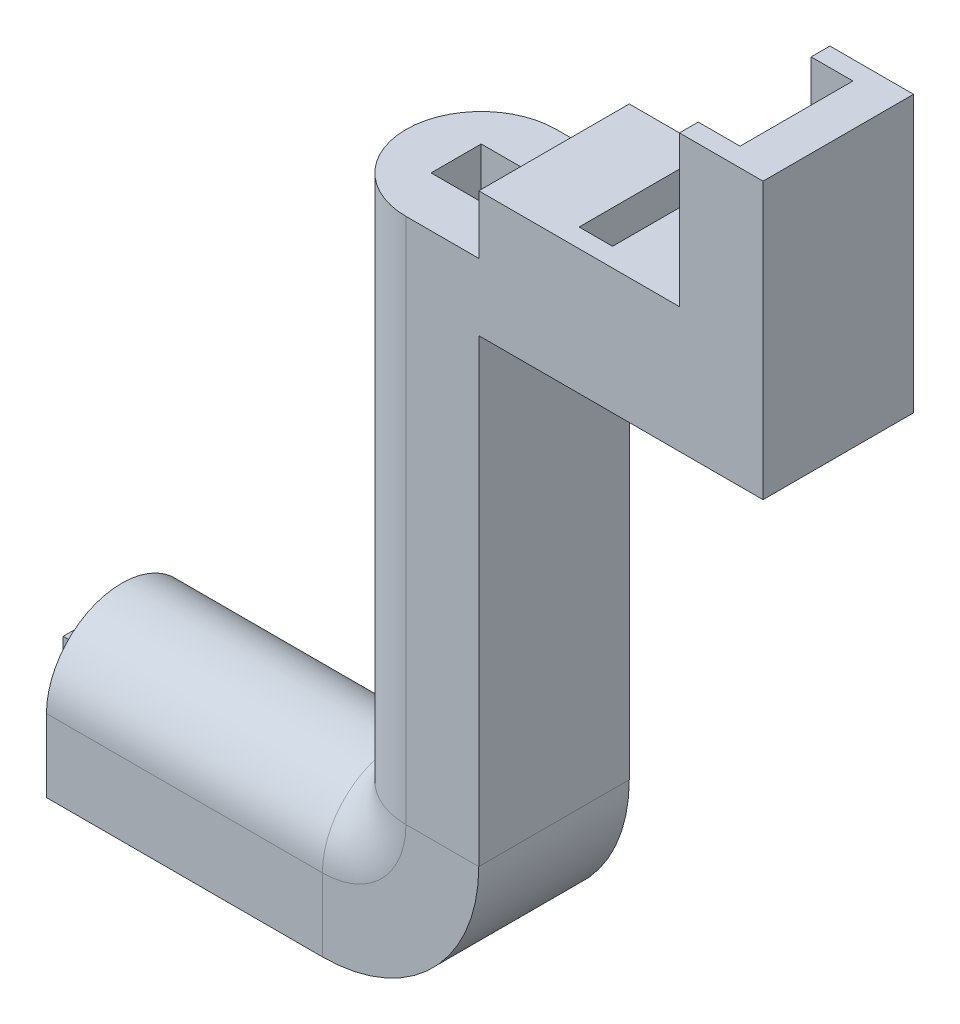
ISO-10303-21;
HEADER;
FILE_DESCRIPTION(('STEP AP214'),'2;1');
FILE_NAME('part.step','',(''),(''),'','','');
FILE_SCHEMA(('AUTOMOTIVE_DESIGN { 1 0 10303 214 1 1 1 1 }'));
ENDSEC;
DATA;
#1=APPLICATION_CONTEXT('core data for automotive mechanical design processes');
#2=APPLICATION_PROTOCOL_DEFINITION('international standard','automotive_design',2000,#1);
#3=PRODUCT_CONTEXT('',#1,'mechanical');
#4=PRODUCT('Part','Part','',(#3));
#5=PRODUCT_RELATED_PRODUCT_CATEGORY('part','',(#4));
#6=PRODUCT_DEFINITION_FORMATION('','',#4);
#7=PRODUCT_DEFINITION_CONTEXT('part definition',#1,'design');
#8=PRODUCT_DEFINITION('design','',#6,#7);
#9=PRODUCT_DEFINITION_SHAPE('','',#8);
#10=(LENGTH_UNIT() NAMED_UNIT(*) SI_UNIT(.MILLI.,.METRE.));
#11=(NAMED_UNIT(*) PLANE_ANGLE_UNIT() SI_UNIT($,.RADIAN.));
#12=(NAMED_UNIT(*) SI_UNIT($,.STERADIAN.) SOLID_ANGLE_UNIT());
#13=UNCERTAINTY_MEASURE_WITH_UNIT(LENGTH_MEASURE(1.E-05),#10,'distance_accuracy_value','');
#14=(GEOMETRIC_REPRESENTATION_CONTEXT(3) GLOBAL_UNCERTAINTY_ASSIGNED_CONTEXT((#13)) GLOBAL_UNIT_ASSIGNED_CONTEXT((#10,
#11,#12)) REPRESENTATION_CONTEXT('',''));
#15=CARTESIAN_POINT('',(0.,0.,0.));
#16=DIRECTION('',(0.,0.,1.));
#17=DIRECTION('',(1.,0.,0.));
#18=AXIS2_PLACEMENT_3D('',#15,#16,#17);
#19=CARTESIAN_POINT('',(0.,90.7082039324991,0.));
#20=DIRECTION('',(0.,-1.,0.));
#21=DIRECTION('',(0.,0.,-1.));
#22=AXIS2_PLACEMENT_3D('',#19,#20,#21);
#23=PLANE('',#22);
#24=DIRECTION('',(-1.,0.,0.));
#25=VECTOR('',#24,1.);
#26=CARTESIAN_POINT('',(42.,90.7082039324991,9.00000000000001));
#27=LINE('',#26,#25);
#28=CARTESIAN_POINT('',(60.7082039324993,90.7082039324991,9.00000000000003));
#29=VERTEX_POINT('',#28);
#30=CARTESIAN_POINT('',(52.,90.7082039324991,9.));
#31=VERTEX_POINT('',#30);
#32=EDGE_CURVE('E289',#29,#31,#27,.T.);
#33=ORIENTED_EDGE('',*,*,#32,.F.);
#34=DIRECTION('',(0.,0.,1.));
#35=VECTOR('',#34,1.);
#36=CARTESIAN_POINT('',(60.7082039324993,90.7082039324991,-9.));
#37=LINE('',#36,#35);
#38=CARTESIAN_POINT('',(60.7082039324993,90.7082039324991,-9.));
#39=VERTEX_POINT('',#38);
#40=EDGE_CURVE('E292',#39,#29,#37,.T.);
#41=ORIENTED_EDGE('',*,*,#40,.F.);
#42=DIRECTION('',(1.,0.,0.));
#43=VECTOR('',#42,1.);
#44=CARTESIAN_POINT('',(42.,90.7082039324991,-9.));
#45=LINE('',#44,#43);
#46=CARTESIAN_POINT('',(52.,90.7082039324991,-9.));
#47=VERTEX_POINT('',#46);
#48=EDGE_CURVE('E295',#47,#39,#45,.T.);
#49=ORIENTED_EDGE('',*,*,#48,.F.);
#50=CARTESIAN_POINT('',(52.,90.7082039324991,0.));
#51=DIRECTION('',(0.,-1.,0.));
#52=DIRECTION('',(0.,0.,-1.));
#53=AXIS2_PLACEMENT_3D('',#50,#51,#52);
#54=CIRCLE('',#53,9.);
#55=EDGE_CURVE('E63',#31,#47,#54,.T.);
#56=ORIENTED_EDGE('',*,*,#55,.F.);
#57=EDGE_LOOP('',(#33,#41,#49,#56));
#58=FACE_BOUND('',#57,.T.);
#59=DIRECTION('',(0.,0.,1.));
#60=VECTOR('',#59,1.);
#61=CARTESIAN_POINT('',(55.,90.7082039324991,3.));
#62=LINE('',#61,#60);
#63=CARTESIAN_POINT('',(55.,90.7082039324991,-3.));
#64=VERTEX_POINT('',#63);
#65=CARTESIAN_POINT('',(55.,90.7082039324991,3.));
#66=VERTEX_POINT('',#65);
#67=EDGE_CURVE('E55',#64,#66,#62,.T.);
#68=ORIENTED_EDGE('',*,*,#67,.T.);
#69=DIRECTION('',(-1.,0.,0.));
#70=VECTOR('',#69,1.);
#71=CARTESIAN_POINT('',(49.,90.7082039324991,3.));
#72=LINE('',#71,#70);
#73=CARTESIAN_POINT('',(49.,90.7082039324991,3.));
#74=VERTEX_POINT('',#73);
#75=EDGE_CURVE('E261',#66,#74,#72,.T.);
#76=ORIENTED_EDGE('',*,*,#75,.T.);
#77=DIRECTION('',(0.,0.,-1.));
#78=VECTOR('',#77,1.);
#79=CARTESIAN_POINT('',(49.,90.7082039324991,3.));
#80=LINE('',#79,#78);
#81=CARTESIAN_POINT('',(49.,90.7082039324991,-3.));
#82=VERTEX_POINT('',#81);
#83=EDGE_CURVE('E265',#74,#82,#80,.T.);
#84=ORIENTED_EDGE('',*,*,#83,.T.);
#85=DIRECTION('',(1.,0.,0.));
#86=VECTOR('',#85,1.);
#87=CARTESIAN_POINT('',(49.,90.7082039324991,-3.));
#88=LINE('',#87,#86);
#89=EDGE_CURVE('E274',#82,#64,#88,.T.);
#90=ORIENTED_EDGE('',*,*,#89,.T.);
#91=EDGE_LOOP('',(#68,#76,#84,#90));
#92=FACE_BOUND('',#91,.T.);
#93=ADVANCED_FACE('F39',(#58,#92),#23,.F.);
#94=CARTESIAN_POINT('',(52.,97.7082039324994,0.));
#95=DIRECTION('',(0.,1.,0.));
#96=DIRECTION('',(0.,0.,-1.));
#97=AXIS2_PLACEMENT_3D('',#94,#95,#96);
#98=PLANE('',#97);
#99=DIRECTION('',(0.,0.,1.));
#100=VECTOR('',#99,1.);
#101=CARTESIAN_POINT('',(70.4582039324994,97.7082039324994,6.75000000000001));
#102=LINE('',#101,#100);
#103=CARTESIAN_POINT('',(70.4582039324994,97.7082039324994,-6.74999999999999));
#104=VERTEX_POINT('',#103);
#105=CARTESIAN_POINT('',(70.4582039324994,97.7082039324994,6.75000000000001));
#106=VERTEX_POINT('',#105);
#107=EDGE_CURVE('E363',#104,#106,#102,.T.);
#108=ORIENTED_EDGE('',*,*,#107,.F.);
#109=DIRECTION('',(-1.,0.,0.));
#110=VECTOR('',#109,1.);
#111=CARTESIAN_POINT('',(74.4582039324994,97.7082039324994,-6.74999999999999));
#112=LINE('',#111,#110);
#113=CARTESIAN_POINT('',(74.4582039324994,97.7082039324994,-6.74999999999999));
#114=VERTEX_POINT('',#113);
#115=EDGE_CURVE('E369',#114,#104,#112,.T.);
#116=ORIENTED_EDGE('',*,*,#115,.F.);
#117=DIRECTION('',(0.,0.,-1.));
#118=VECTOR('',#117,1.);
#119=CARTESIAN_POINT('',(74.4582039324994,97.7082039324994,6.75000000000001));
#120=LINE('',#119,#118);
#121=CARTESIAN_POINT('',(74.4582039324994,97.7082039324994,6.75000000000001));
#122=VERTEX_POINT('',#121);
#123=EDGE_CURVE('E388',#122,#114,#120,.T.);
#124=ORIENTED_EDGE('',*,*,#123,.F.);
#125=DIRECTION('',(1.,0.,0.));
#126=VECTOR('',#125,1.);
#127=CARTESIAN_POINT('',(74.4582039324994,97.7082039324994,6.75000000000001));
#128=LINE('',#127,#126);
#129=EDGE_CURVE('E384',#106,#122,#128,.T.);
#130=ORIENTED_EDGE('',*,*,#129,.F.);
#131=EDGE_LOOP('',(#108,#116,#124,#130));
#132=FACE_BOUND('',#131,.T.);
#133=DIRECTION('',(-1.,0.,0.));
#134=VECTOR('',#133,1.);
#135=CARTESIAN_POINT('',(60.7082039324994,97.7082039324994,-9.));
#136=LINE('',#135,#134);
#137=CARTESIAN_POINT('',(84.7082039324993,97.7082039324994,-8.99999999999999));
#138=VERTEX_POINT('',#137);
#139=CARTESIAN_POINT('',(60.7082039324993,97.7082039324991,-9.));
#140=VERTEX_POINT('',#139);
#141=EDGE_CURVE('E474',#138,#140,#136,.T.);
#142=ORIENTED_EDGE('',*,*,#141,.T.);
#143=DIRECTION('',(0.,0.,1.));
#144=VECTOR('',#143,1.);
#145=CARTESIAN_POINT('',(60.7082039324993,97.7082039324991,-9.));
#146=LINE('',#145,#144);
#147=CARTESIAN_POINT('',(60.7082039324993,97.7082039324991,9.00000000000003));
#148=VERTEX_POINT('',#147);
#149=EDGE_CURVE('E283',#140,#148,#146,.T.);
#150=ORIENTED_EDGE('',*,*,#149,.T.);
#151=DIRECTION('',(1.,0.,0.));
#152=VECTOR('',#151,1.);
#153=CARTESIAN_POINT('',(52.,97.7082039324994,9.));
#154=LINE('',#153,#152);
#155=CARTESIAN_POINT('',(84.7082039324993,97.7082039324994,8.99999999999999));
#156=VERTEX_POINT('',#155);
#157=EDGE_CURVE('E504',#148,#156,#154,.T.);
#158=ORIENTED_EDGE('',*,*,#157,.T.);
#159=DIRECTION('',(0.,0.,-1.));
#160=VECTOR('',#159,1.);
#161=CARTESIAN_POINT('',(84.7082039324993,97.7082039324994,56.3814309619285));
#162=LINE('',#161,#160);
#163=CARTESIAN_POINT('',(84.7082039324994,97.7082039324994,6.75));
#164=VERTEX_POINT('',#163);
#165=EDGE_CURVE('E475',#156,#164,#162,.T.);
#166=ORIENTED_EDGE('',*,*,#165,.T.);
#167=DIRECTION('',(-1.,0.,0.));
#168=VECTOR('',#167,1.);
#169=CARTESIAN_POINT('',(89.7082039324994,97.7082039324994,6.75));
#170=LINE('',#169,#168);
#171=CARTESIAN_POINT('',(89.7082039324994,97.7082039324994,6.75));
#172=VERTEX_POINT('',#171);
#173=EDGE_CURVE('E415',#172,#164,#170,.T.);
#174=ORIENTED_EDGE('',*,*,#173,.F.);
#175=DIRECTION('',(0.,0.,1.));
#176=VECTOR('',#175,1.);
#177=CARTESIAN_POINT('',(89.7082039324994,97.7082039324994,6.75));
#178=LINE('',#177,#176);
#179=CARTESIAN_POINT('',(89.7082039324994,97.7082039324994,-6.75));
#180=VERTEX_POINT('',#179);
#181=EDGE_CURVE('E408',#180,#172,#178,.T.);
#182=ORIENTED_EDGE('',*,*,#181,.F.);
#183=DIRECTION('',(1.,0.,0.));
#184=VECTOR('',#183,1.);
#185=CARTESIAN_POINT('',(89.7082039324994,97.7082039324994,-6.75));
#186=LINE('',#185,#184);
#187=CARTESIAN_POINT('',(84.7082039324994,97.7082039324994,-6.75));
#188=VERTEX_POINT('',#187);
#189=EDGE_CURVE('E411',#188,#180,#186,.T.);
#190=ORIENTED_EDGE('',*,*,#189,.F.);
#191=EDGE_CURVE('E456',#188,#138,#162,.T.);
#192=ORIENTED_EDGE('',*,*,#191,.T.);
#193=EDGE_LOOP('',(#142,#150,#158,#166,#174,#182,#190,#192));
#194=FACE_BOUND('',#193,.T.);
#195=ADVANCED_FACE('F637',(#132,#194),#98,.T.);
#196=CARTESIAN_POINT('',(60.7082039324994,97.7082039324994,-9.));
#197=DIRECTION('',(0.,0.,1.));
#198=DIRECTION('',(1.,0.,0.));
#199=AXIS2_PLACEMENT_3D('',#196,#197,#198);
#200=PLANE('',#199);
#201=DIRECTION('',(0.,1.,0.));
#202=VECTOR('',#201,1.);
#203=CARTESIAN_POINT('',(60.7082039324993,90.7082039324991,-9.));
#204=LINE('',#203,#202);
#205=EDGE_CURVE('E303',#39,#140,#204,.T.);
#206=ORIENTED_EDGE('',*,*,#205,.T.);
#207=ORIENTED_EDGE('',*,*,#141,.F.);
#208=DIRECTION('',(0.,1.,0.));
#209=VECTOR('',#208,1.);
#210=CARTESIAN_POINT('',(84.7082039324993,97.7082039324994,-8.99999999999999));
#211=LINE('',#210,#209);
#212=CARTESIAN_POINT('',(84.7082039324994,115.708203932499,-9.));
#213=VERTEX_POINT('',#212);
#214=EDGE_CURVE('E448',#138,#213,#211,.T.);
#215=ORIENTED_EDGE('',*,*,#214,.T.);
#216=DIRECTION('',(1.,0.,0.));
#217=VECTOR('',#216,1.);
#218=CARTESIAN_POINT('',(94.7082039324993,115.708203932499,-8.99999999999999));
#219=LINE('',#218,#217);
#220=CARTESIAN_POINT('',(94.7082039324994,115.708203932499,-8.99999999999999));
#221=VERTEX_POINT('',#220);
#222=EDGE_CURVE('E444',#213,#221,#219,.T.);
#223=ORIENTED_EDGE('',*,*,#222,.T.);
#224=DIRECTION('',(0.,-1.,0.));
#225=VECTOR('',#224,1.);
#226=CARTESIAN_POINT('',(94.7082039324994,82.7082039324994,-8.99999999999999));
#227=LINE('',#226,#225);
#228=CARTESIAN_POINT('',(94.7082039324994,82.7082039324994,-8.99999999999999));
#229=VERTEX_POINT('',#228);
#230=EDGE_CURVE('E440',#221,#229,#227,.T.);
#231=ORIENTED_EDGE('',*,*,#230,.T.);
#232=DIRECTION('',(-1.,0.,0.));
#233=VECTOR('',#232,1.);
#234=CARTESIAN_POINT('',(60.7082039324994,82.7082039324994,-9.));
#235=LINE('',#234,#233);
#236=CARTESIAN_POINT('',(60.7082039324994,82.7082039324994,-9.));
#237=VERTEX_POINT('',#236);
#238=EDGE_CURVE('E452',#229,#237,#235,.T.);
#239=ORIENTED_EDGE('',*,*,#238,.T.);
#240=DIRECTION('',(0.,-1.,0.));
#241=VECTOR('',#240,1.);
#242=CARTESIAN_POINT('',(60.7082039324994,97.7082039324994,-9.));
#243=LINE('',#242,#241);
#244=CARTESIAN_POINT('',(60.7082039324994,27.7082039324994,-9.));
#245=VERTEX_POINT('',#244);
#246=EDGE_CURVE('E497',#237,#245,#243,.T.);
#247=ORIENTED_EDGE('',*,*,#246,.T.);
#248=DIRECTION('',(-1.,0.,0.));
#249=VECTOR('',#248,1.);
#250=CARTESIAN_POINT('',(60.7082039324994,27.7082039324994,-9.));
#251=LINE('',#250,#249);
#252=CARTESIAN_POINT('',(52.,27.7082039324994,-9.));
#253=VERTEX_POINT('',#252);
#254=EDGE_CURVE('E501',#245,#253,#251,.T.);
#255=ORIENTED_EDGE('',*,*,#254,.T.);
#256=DIRECTION('',(0.,-1.,0.));
#257=VECTOR('',#256,1.);
#258=CARTESIAN_POINT('',(52.,97.7082039324994,-9.));
#259=LINE('',#258,#257);
#260=EDGE_CURVE('E525',#47,#253,#259,.T.);
#261=ORIENTED_EDGE('',*,*,#260,.F.);
#262=ORIENTED_EDGE('',*,*,#48,.T.);
#263=EDGE_LOOP('',(#206,#207,#215,#223,#231,#239,#247,#255,#261,#262));
#264=FACE_BOUND('',#263,.T.);
#265=ADVANCED_FACE('F612',(#264),#200,.F.);
#266=CARTESIAN_POINT('',(52.,97.7082039324994,9.));
#267=DIRECTION('',(0.,0.,-1.));
#268=DIRECTION('',(-1.,0.,0.));
#269=AXIS2_PLACEMENT_3D('',#266,#267,#268);
#270=PLANE('',#269);
#271=DIRECTION('',(0.,1.,0.));
#272=VECTOR('',#271,1.);
#273=CARTESIAN_POINT('',(60.7082039324993,90.7082039324991,9.00000000000003));
#274=LINE('',#273,#272);
#275=EDGE_CURVE('E299',#29,#148,#274,.T.);
#276=ORIENTED_EDGE('',*,*,#275,.F.);
#277=ORIENTED_EDGE('',*,*,#32,.T.);
#278=DIRECTION('',(0.,-1.,0.));
#279=VECTOR('',#278,1.);
#280=CARTESIAN_POINT('',(52.,97.7082039324994,9.));
#281=LINE('',#280,#279);
#282=CARTESIAN_POINT('',(52.,27.7082039324994,9.));
#283=VERTEX_POINT('',#282);
#284=EDGE_CURVE('E540',#31,#283,#281,.T.);
#285=ORIENTED_EDGE('',*,*,#284,.T.);
#286=DIRECTION('',(1.,0.,0.));
#287=VECTOR('',#286,1.);
#288=CARTESIAN_POINT('',(52.,27.7082039324994,9.));
#289=LINE('',#288,#287);
#290=CARTESIAN_POINT('',(60.7082039324994,27.7082039324994,9.));
#291=VERTEX_POINT('',#290);
#292=EDGE_CURVE('E518',#283,#291,#289,.T.);
#293=ORIENTED_EDGE('',*,*,#292,.T.);
#294=DIRECTION('',(0.,-1.,0.));
#295=VECTOR('',#294,1.);
#296=CARTESIAN_POINT('',(60.7082039324994,97.7082039324994,9.));
#297=LINE('',#296,#295);
#298=CARTESIAN_POINT('',(60.7082039324994,82.7082039324994,9.));
#299=VERTEX_POINT('',#298);
#300=EDGE_CURVE('E498',#299,#291,#297,.T.);
#301=ORIENTED_EDGE('',*,*,#300,.F.);
#302=DIRECTION('',(-1.,0.,0.));
#303=VECTOR('',#302,1.);
#304=CARTESIAN_POINT('',(60.7082039324994,82.7082039324994,9.));
#305=LINE('',#304,#303);
#306=CARTESIAN_POINT('',(94.7082039324994,82.7082039324994,8.99999999999999));
#307=VERTEX_POINT('',#306);
#308=EDGE_CURVE('E470',#307,#299,#305,.T.);
#309=ORIENTED_EDGE('',*,*,#308,.F.);
#310=DIRECTION('',(0.,-1.,0.));
#311=VECTOR('',#310,1.);
#312=CARTESIAN_POINT('',(94.7082039324994,82.7082039324994,8.99999999999999));
#313=LINE('',#312,#311);
#314=CARTESIAN_POINT('',(94.7082039324994,115.708203932499,8.99999999999999));
#315=VERTEX_POINT('',#314);
#316=EDGE_CURVE('E466',#315,#307,#313,.T.);
#317=ORIENTED_EDGE('',*,*,#316,.F.);
#318=DIRECTION('',(1.,0.,0.));
#319=VECTOR('',#318,1.);
#320=CARTESIAN_POINT('',(94.7082039324993,115.708203932499,8.99999999999999));
#321=LINE('',#320,#319);
#322=CARTESIAN_POINT('',(84.7082039324994,115.708203932499,8.99999999999999));
#323=VERTEX_POINT('',#322);
#324=EDGE_CURVE('E461',#323,#315,#321,.T.);
#325=ORIENTED_EDGE('',*,*,#324,.F.);
#326=DIRECTION('',(0.,1.,0.));
#327=VECTOR('',#326,1.);
#328=CARTESIAN_POINT('',(84.7082039324993,97.7082039324994,8.99999999999999));
#329=LINE('',#328,#327);
#330=EDGE_CURVE('E457',#156,#323,#329,.T.);
#331=ORIENTED_EDGE('',*,*,#330,.F.);
#332=ORIENTED_EDGE('',*,*,#157,.F.);
#333=EDGE_LOOP('',(#276,#277,#285,#293,#301,#309,#317,#325,#331,#332));
#334=FACE_BOUND('',#333,.T.);
#335=ADVANCED_FACE('F605',(#334),#270,.F.);
#336=CARTESIAN_POINT('',(-38.5,9.,-9.));
#337=DIRECTION('',(0.,-1.,0.));
#338=DIRECTION('',(0.,0.,-1.));
#339=AXIS2_PLACEMENT_3D('',#336,#337,#338);
#340=PLANE('',#339);
#341=DIRECTION('',(1.,0.,0.));
#342=VECTOR('',#341,1.);
#343=CARTESIAN_POINT('',(-38.5,9.,9.));
#344=LINE('',#343,#342);
#345=CARTESIAN_POINT('',(9.,9.,9.));
#346=VERTEX_POINT('',#345);
#347=CARTESIAN_POINT('',(42.,9.,9.));
#348=VERTEX_POINT('',#347);
#349=EDGE_CURVE('E565',#346,#348,#344,.T.);
#350=ORIENTED_EDGE('',*,*,#349,.F.);
#351=DIRECTION('',(0.,0.,-1.));
#352=VECTOR('',#351,1.);
#353=CARTESIAN_POINT('',(9.,9.,-9.));
#354=LINE('',#353,#352);
#355=CARTESIAN_POINT('',(9.,9.,-9.));
#356=VERTEX_POINT('',#355);
#357=EDGE_CURVE('E356',#346,#356,#354,.T.);
#358=ORIENTED_EDGE('',*,*,#357,.T.);
#359=DIRECTION('',(1.,0.,0.));
#360=VECTOR('',#359,1.);
#361=CARTESIAN_POINT('',(-38.5,9.,-9.));
#362=LINE('',#361,#360);
#363=CARTESIAN_POINT('',(42.,9.,-9.));
#364=VERTEX_POINT('',#363);
#365=EDGE_CURVE('E562',#356,#364,#362,.T.);
#366=ORIENTED_EDGE('',*,*,#365,.T.);
#367=DIRECTION('',(0.,0.,-1.));
#368=VECTOR('',#367,1.);
#369=CARTESIAN_POINT('',(42.,9.,9.));
#370=LINE('',#369,#368);
#371=EDGE_CURVE('E505',#348,#364,#370,.T.);
#372=ORIENTED_EDGE('',*,*,#371,.F.);
#373=EDGE_LOOP('',(#350,#358,#366,#372));
#374=FACE_BOUND('',#373,.T.);
#375=ADVANCED_FACE('F599',(#374),#340,.T.);
#376=CARTESIAN_POINT('',(-38.5,17.7082039324994,0.));
#377=DIRECTION('',(1.,0.,0.));
#378=DIRECTION('',(0.,0.,-1.));
#379=AXIS2_PLACEMENT_3D('',#376,#377,#378);
#380=CYLINDRICAL_SURFACE('',#379,9.);
#381=DIRECTION('',(1.,0.,0.));
#382=VECTOR('',#381,1.);
#383=CARTESIAN_POINT('',(-38.5,17.7082039324994,-9.));
#384=LINE('',#383,#382);
#385=CARTESIAN_POINT('',(9.,17.7082039324994,-9.));
#386=VERTEX_POINT('',#385);
#387=CARTESIAN_POINT('',(42.,17.7082039324994,-9.));
#388=VERTEX_POINT('',#387);
#389=EDGE_CURVE('E48',#386,#388,#384,.T.);
#390=ORIENTED_EDGE('',*,*,#389,.F.);
#391=CARTESIAN_POINT('',(9.,17.7082039324994,0.));
#392=DIRECTION('',(-1.,0.,0.));
#393=DIRECTION('',(0.,0.,1.));
#394=AXIS2_PLACEMENT_3D('',#391,#392,#393);
#395=CIRCLE('',#394,9.);
#396=CARTESIAN_POINT('',(9.,17.7082039324994,9.));
#397=VERTEX_POINT('',#396);
#398=EDGE_CURVE('E352',#386,#397,#395,.F.);
#399=ORIENTED_EDGE('',*,*,#398,.T.);
#400=DIRECTION('',(1.,0.,0.));
#401=VECTOR('',#400,1.);
#402=CARTESIAN_POINT('',(-38.5,17.7082039324994,9.));
#403=LINE('',#402,#401);
#404=CARTESIAN_POINT('',(42.,17.7082039324994,9.));
#405=VERTEX_POINT('',#404);
#406=EDGE_CURVE('E559',#397,#405,#403,.T.);
#407=ORIENTED_EDGE('',*,*,#406,.T.);
#408=CARTESIAN_POINT('',(42.,17.7082039324994,0.));
#409=DIRECTION('',(1.,0.,0.));
#410=DIRECTION('',(0.,0.,-1.));
#411=AXIS2_PLACEMENT_3D('',#408,#409,#410);
#412=CIRCLE('',#411,9.);
#413=EDGE_CURVE('E536',#388,#405,#412,.T.);
#414=ORIENTED_EDGE('',*,*,#413,.F.);
#415=EDGE_LOOP('',(#390,#399,#407,#414));
#416=FACE_BOUND('',#415,.T.);
#417=ADVANCED_FACE('F41',(#416),#380,.T.);
#418=CARTESIAN_POINT('',(-38.5,17.7082039324994,-9.));
#419=DIRECTION('',(0.,0.,-1.));
#420=DIRECTION('',(-1.,0.,0.));
#421=AXIS2_PLACEMENT_3D('',#418,#419,#420);
#422=PLANE('',#421);
#423=ORIENTED_EDGE('',*,*,#365,.F.);
#424=DIRECTION('',(0.,1.,0.));
#425=VECTOR('',#424,1.);
#426=CARTESIAN_POINT('',(9.,17.7082039324994,-9.));
#427=LINE('',#426,#425);
#428=EDGE_CURVE('E359',#356,#386,#427,.T.);
#429=ORIENTED_EDGE('',*,*,#428,.T.);
#430=ORIENTED_EDGE('',*,*,#389,.T.);
#431=DIRECTION('',(0.,1.,0.));
#432=VECTOR('',#431,1.);
#433=CARTESIAN_POINT('',(42.,9.,-9.));
#434=LINE('',#433,#432);
#435=EDGE_CURVE('E514',#364,#388,#434,.T.);
#436=ORIENTED_EDGE('',*,*,#435,.F.);
#437=EDGE_LOOP('',(#423,#429,#430,#436));
#438=FACE_BOUND('',#437,.T.);
#439=ADVANCED_FACE('F593',(#438),#422,.T.);
#440=CARTESIAN_POINT('',(-38.5,9.,9.));
#441=DIRECTION('',(0.,0.,1.));
#442=DIRECTION('',(0.,-1.,0.));
#443=AXIS2_PLACEMENT_3D('',#440,#441,#442);
#444=PLANE('',#443);
#445=ORIENTED_EDGE('',*,*,#406,.F.);
#446=DIRECTION('',(0.,-1.,0.));
#447=VECTOR('',#446,1.);
#448=CARTESIAN_POINT('',(9.,9.,9.));
#449=LINE('',#448,#447);
#450=EDGE_CURVE('E11',#397,#346,#449,.T.);
#451=ORIENTED_EDGE('',*,*,#450,.T.);
#452=ORIENTED_EDGE('',*,*,#349,.T.);
#453=DIRECTION('',(0.,-1.,0.));
#454=VECTOR('',#453,1.);
#455=CARTESIAN_POINT('',(42.,17.7082039324994,9.));
#456=LINE('',#455,#454);
#457=EDGE_CURVE('E550',#405,#348,#456,.T.);
#458=ORIENTED_EDGE('',*,*,#457,.F.);
#459=EDGE_LOOP('',(#445,#451,#452,#458));
#460=FACE_BOUND('',#459,.T.);
#461=ADVANCED_FACE('F574',(#460),#444,.T.);
#462=CARTESIAN_POINT('',(84.7082039324993,97.7082039324994,56.3814309619285));
#463=DIRECTION('',(1.,0.,0.));
#464=DIRECTION('',(0.,1.,0.));
#465=AXIS2_PLACEMENT_3D('',#462,#463,#464);
#466=PLANE('',#465);
#467=ORIENTED_EDGE('',*,*,#191,.F.);
#468=DIRECTION('',(0.,1.,0.));
#469=VECTOR('',#468,1.);
#470=CARTESIAN_POINT('',(84.7082039324994,83.3120238836114,-6.75));
#471=LINE('',#470,#469);
#472=CARTESIAN_POINT('',(84.7082039324994,115.708203932499,-6.75));
#473=VERTEX_POINT('',#472);
#474=EDGE_CURVE('E412',#188,#473,#471,.T.);
#475=ORIENTED_EDGE('',*,*,#474,.T.);
#476=DIRECTION('',(0.,0.,-1.));
#477=VECTOR('',#476,1.);
#478=CARTESIAN_POINT('',(84.7082039324994,115.708203932499,56.3814309619285));
#479=LINE('',#478,#477);
#480=EDGE_CURVE('E479',#473,#213,#479,.T.);
#481=ORIENTED_EDGE('',*,*,#480,.T.);
#482=ORIENTED_EDGE('',*,*,#214,.F.);
#483=EDGE_LOOP('',(#467,#475,#481,#482));
#484=FACE_BOUND('',#483,.T.);
#485=ADVANCED_FACE('F646',(#484),#466,.F.);
#486=CARTESIAN_POINT('',(60.7082039324994,97.7082039324994,9.));
#487=DIRECTION('',(-1.,0.,0.));
#488=DIRECTION('',(0.,0.,1.));
#489=AXIS2_PLACEMENT_3D('',#486,#487,#488);
#490=PLANE('',#489);
#491=DIRECTION('',(0.,0.,-1.));
#492=VECTOR('',#491,1.);
#493=CARTESIAN_POINT('',(60.7082039324994,82.7082039324994,56.3814309619285));
#494=LINE('',#493,#492);
#495=EDGE_CURVE('E462',#299,#237,#494,.T.);
#496=ORIENTED_EDGE('',*,*,#495,.F.);
#497=ORIENTED_EDGE('',*,*,#300,.T.);
#498=DIRECTION('',(0.,0.,-1.));
#499=VECTOR('',#498,1.);
#500=CARTESIAN_POINT('',(60.7082039324994,27.7082039324994,9.));
#501=LINE('',#500,#499);
#502=EDGE_CURVE('E493',#291,#245,#501,.T.);
#503=ORIENTED_EDGE('',*,*,#502,.T.);
#504=ORIENTED_EDGE('',*,*,#246,.F.);
#505=EDGE_LOOP('',(#496,#497,#503,#504));
#506=FACE_BOUND('',#505,.T.);
#507=ADVANCED_FACE('F614',(#506),#490,.F.);
#508=CARTESIAN_POINT('',(52.,97.7082039324994,0.));
#509=DIRECTION('',(0.,-1.,0.));
#510=DIRECTION('',(0.,0.,-1.));
#511=AXIS2_PLACEMENT_3D('',#508,#509,#510);
#512=CYLINDRICAL_SURFACE('',#511,9.);
#513=ORIENTED_EDGE('',*,*,#284,.F.);
#514=ORIENTED_EDGE('',*,*,#55,.T.);
#515=ORIENTED_EDGE('',*,*,#260,.T.);
#516=CARTESIAN_POINT('',(52.,27.7082039324994,0.));
#517=DIRECTION('',(0.,1.,0.));
#518=DIRECTION('',(0.,0.,-1.));
#519=AXIS2_PLACEMENT_3D('',#516,#517,#518);
#520=CIRCLE('',#519,9.);
#521=EDGE_CURVE('E528',#253,#283,#520,.T.);
#522=ORIENTED_EDGE('',*,*,#521,.T.);
#523=EDGE_LOOP('',(#513,#514,#515,#522));
#524=FACE_BOUND('',#523,.T.);
#525=ADVANCED_FACE('F609',(#524),#512,.T.);
#526=CARTESIAN_POINT('',(42.,27.7082039324994,0.));
#527=DIRECTION('',(0.,0.,-1.));
#528=DIRECTION('',(-1.,0.,0.));
#529=AXIS2_PLACEMENT_3D('',#526,#527,#528);
#530=CYLINDRICAL_SURFACE('',#529,18.7082039324994);
#531=CARTESIAN_POINT('',(42.,27.7082039324994,-9.));
#532=DIRECTION('',(0.,0.,-1.));
#533=DIRECTION('',(1.,0.,0.));
#534=AXIS2_PLACEMENT_3D('',#531,#532,#533);
#535=CIRCLE('',#534,18.7082039324994);
#536=EDGE_CURVE('E509',#245,#364,#535,.T.);
#537=ORIENTED_EDGE('',*,*,#536,.F.);
#538=ORIENTED_EDGE('',*,*,#502,.F.);
#539=CARTESIAN_POINT('',(42.,27.7082039324994,9.));
#540=DIRECTION('',(0.,0.,-1.));
#541=DIRECTION('',(1.,0.,0.));
#542=AXIS2_PLACEMENT_3D('',#539,#540,#541);
#543=CIRCLE('',#542,18.7082039324994);
#544=EDGE_CURVE('E510',#291,#348,#543,.T.);
#545=ORIENTED_EDGE('',*,*,#544,.T.);
#546=ORIENTED_EDGE('',*,*,#371,.T.);
#547=EDGE_LOOP('',(#537,#538,#545,#546));
#548=FACE_BOUND('',#547,.T.);
#549=ADVANCED_FACE('F602',(#548),#530,.T.);
#550=CARTESIAN_POINT('',(60.7082039324994,27.7082039324994,-9.));
#551=DIRECTION('',(0.,0.,1.));
#552=DIRECTION('',(1.,0.,0.));
#553=AXIS2_PLACEMENT_3D('',#550,#551,#552);
#554=PLANE('',#553);
#555=CARTESIAN_POINT('',(42.,27.7082039324994,-9.));
#556=DIRECTION('',(0.,0.,-1.));
#557=DIRECTION('',(1.,0.,0.));
#558=AXIS2_PLACEMENT_3D('',#555,#556,#557);
#559=CIRCLE('',#558,10.);
#560=EDGE_CURVE('E532',#253,#388,#559,.T.);
#561=ORIENTED_EDGE('',*,*,#560,.F.);
#562=ORIENTED_EDGE('',*,*,#254,.F.);
#563=ORIENTED_EDGE('',*,*,#536,.T.);
#564=ORIENTED_EDGE('',*,*,#435,.T.);
#565=EDGE_LOOP('',(#561,#562,#563,#564));
#566=FACE_BOUND('',#565,.T.);
#567=ADVANCED_FACE('F589',(#566),#554,.F.);
#568=CARTESIAN_POINT('',(42.,27.7082039324994,0.));
#569=DIRECTION('',(0.,0.,-1.));
#570=DIRECTION('',(-1.,0.,0.));
#571=AXIS2_PLACEMENT_3D('',#568,#569,#570);
#572=TOROIDAL_SURFACE('',#571,10.,9.);
#573=CARTESIAN_POINT('',(42.,27.7082039324994,9.));
#574=DIRECTION('',(0.,0.,-1.));
#575=DIRECTION('',(1.,0.,0.));
#576=AXIS2_PLACEMENT_3D('',#573,#574,#575);
#577=CIRCLE('',#576,10.);
#578=EDGE_CURVE('E546',#283,#405,#577,.T.);
#579=ORIENTED_EDGE('',*,*,#578,.F.);
#580=ORIENTED_EDGE('',*,*,#521,.F.);
#581=ORIENTED_EDGE('',*,*,#560,.T.);
#582=ORIENTED_EDGE('',*,*,#413,.T.);
#583=EDGE_LOOP('',(#579,#580,#581,#582));
#584=FACE_BOUND('',#583,.T.);
#585=ADVANCED_FACE('F584',(#584),#572,.T.);
#586=CARTESIAN_POINT('',(52.,27.7082039324994,9.));
#587=DIRECTION('',(0.,0.,-1.));
#588=DIRECTION('',(-1.,0.,0.));
#589=AXIS2_PLACEMENT_3D('',#586,#587,#588);
#590=PLANE('',#589);
#591=ORIENTED_EDGE('',*,*,#457,.T.);
#592=ORIENTED_EDGE('',*,*,#544,.F.);
#593=ORIENTED_EDGE('',*,*,#292,.F.);
#594=ORIENTED_EDGE('',*,*,#578,.T.);
#595=EDGE_LOOP('',(#591,#592,#593,#594));
#596=FACE_BOUND('',#595,.T.);
#597=ADVANCED_FACE('F581',(#596),#590,.F.);
#598=CARTESIAN_POINT('',(84.7082039324994,115.708203932499,6.75000000000001));
#599=VERTEX_POINT('',#598);
#600=EDGE_CURVE('E480',#323,#599,#479,.T.);
#601=ORIENTED_EDGE('',*,*,#600,.T.);
#602=DIRECTION('',(0.,1.,0.));
#603=VECTOR('',#602,1.);
#604=CARTESIAN_POINT('',(84.7082039324994,83.3120238836114,6.75));
#605=LINE('',#604,#603);
#606=EDGE_CURVE('E426',#164,#599,#605,.T.);
#607=ORIENTED_EDGE('',*,*,#606,.F.);
#608=ORIENTED_EDGE('',*,*,#165,.F.);
#609=ORIENTED_EDGE('',*,*,#330,.T.);
#610=EDGE_LOOP('',(#601,#607,#608,#609));
#611=FACE_BOUND('',#610,.T.);
#612=ADVANCED_FACE('F634',(#611),#466,.F.);
#613=CARTESIAN_POINT('',(94.7082039324994,115.708203932499,56.3814309619285));
#614=DIRECTION('',(0.,-1.,0.));
#615=DIRECTION('',(0.,0.,-1.));
#616=AXIS2_PLACEMENT_3D('',#613,#614,#615);
#617=PLANE('',#616);
#618=ORIENTED_EDGE('',*,*,#480,.F.);
#619=DIRECTION('',(-1.,0.,0.));
#620=VECTOR('',#619,1.);
#621=CARTESIAN_POINT('',(89.7082039324994,115.708203932499,-6.75));
#622=LINE('',#621,#620);
#623=CARTESIAN_POINT('',(89.7082039324994,115.708203932499,-6.75));
#624=VERTEX_POINT('',#623);
#625=EDGE_CURVE('E423',#624,#473,#622,.T.);
#626=ORIENTED_EDGE('',*,*,#625,.F.);
#627=DIRECTION('',(0.,0.,-1.));
#628=VECTOR('',#627,1.);
#629=CARTESIAN_POINT('',(89.7082039324994,115.708203932499,6.75));
#630=LINE('',#629,#628);
#631=CARTESIAN_POINT('',(89.7082039324994,115.708203932499,6.75));
#632=VERTEX_POINT('',#631);
#633=EDGE_CURVE('E419',#632,#624,#630,.T.);
#634=ORIENTED_EDGE('',*,*,#633,.F.);
#635=DIRECTION('',(1.,0.,0.));
#636=VECTOR('',#635,1.);
#637=CARTESIAN_POINT('',(89.7082039324994,115.708203932499,6.75));
#638=LINE('',#637,#636);
#639=EDGE_CURVE('E398',#599,#632,#638,.T.);
#640=ORIENTED_EDGE('',*,*,#639,.F.);
#641=ORIENTED_EDGE('',*,*,#600,.F.);
#642=ORIENTED_EDGE('',*,*,#324,.T.);
#643=DIRECTION('',(0.,0.,-1.));
#644=VECTOR('',#643,1.);
#645=CARTESIAN_POINT('',(94.7082039324994,115.708203932499,56.3814309619285));
#646=LINE('',#645,#644);
#647=EDGE_CURVE('E484',#315,#221,#646,.T.);
#648=ORIENTED_EDGE('',*,*,#647,.T.);
#649=ORIENTED_EDGE('',*,*,#222,.F.);
#650=EDGE_LOOP('',(#618,#626,#634,#640,#641,#642,#648,#649));
#651=FACE_BOUND('',#650,.T.);
#652=ADVANCED_FACE('F628',(#651),#617,.F.);
#653=CARTESIAN_POINT('',(94.7082039324994,82.7082039324994,56.3814309619285));
#654=DIRECTION('',(-1.,0.,0.));
#655=DIRECTION('',(0.,-1.,0.));
#656=AXIS2_PLACEMENT_3D('',#653,#654,#655);
#657=PLANE('',#656);
#658=ORIENTED_EDGE('',*,*,#647,.F.);
#659=ORIENTED_EDGE('',*,*,#316,.T.);
#660=DIRECTION('',(0.,0.,-1.));
#661=VECTOR('',#660,1.);
#662=CARTESIAN_POINT('',(94.7082039324994,82.7082039324994,56.3814309619285));
#663=LINE('',#662,#661);
#664=EDGE_CURVE('E487',#307,#229,#663,.T.);
#665=ORIENTED_EDGE('',*,*,#664,.T.);
#666=ORIENTED_EDGE('',*,*,#230,.F.);
#667=EDGE_LOOP('',(#658,#659,#665,#666));
#668=FACE_BOUND('',#667,.T.);
#669=ADVANCED_FACE('F624',(#668),#657,.F.);
#670=CARTESIAN_POINT('',(60.7082039324994,82.7082039324994,56.3814309619285));
#671=DIRECTION('',(0.,1.,0.));
#672=DIRECTION('',(0.,0.,1.));
#673=AXIS2_PLACEMENT_3D('',#670,#671,#672);
#674=PLANE('',#673);
#675=ORIENTED_EDGE('',*,*,#664,.F.);
#676=ORIENTED_EDGE('',*,*,#308,.T.);
#677=ORIENTED_EDGE('',*,*,#495,.T.);
#678=ORIENTED_EDGE('',*,*,#238,.F.);
#679=EDGE_LOOP('',(#675,#676,#677,#678));
#680=FACE_BOUND('',#679,.T.);
#681=ADVANCED_FACE('F618',(#680),#674,.F.);
#682=CARTESIAN_POINT('',(89.7082039324994,83.3120238836114,-6.75));
#683=DIRECTION('',(0.,0.,-1.));
#684=DIRECTION('',(-1.,0.,0.));
#685=AXIS2_PLACEMENT_3D('',#682,#683,#684);
#686=PLANE('',#685);
#687=ORIENTED_EDGE('',*,*,#189,.T.);
#688=DIRECTION('',(0.,1.,0.));
#689=VECTOR('',#688,1.);
#690=CARTESIAN_POINT('',(89.7082039324994,83.3120238836114,-6.75));
#691=LINE('',#690,#689);
#692=EDGE_CURVE('E430',#180,#624,#691,.T.);
#693=ORIENTED_EDGE('',*,*,#692,.T.);
#694=ORIENTED_EDGE('',*,*,#625,.T.);
#695=ORIENTED_EDGE('',*,*,#474,.F.);
#696=EDGE_LOOP('',(#687,#693,#694,#695));
#697=FACE_BOUND('',#696,.T.);
#698=ADVANCED_FACE('F654',(#697),#686,.F.);
#699=CARTESIAN_POINT('',(89.7082039324994,83.3120238836114,6.75));
#700=DIRECTION('',(1.,0.,0.));
#701=DIRECTION('',(0.,0.,-1.));
#702=AXIS2_PLACEMENT_3D('',#699,#700,#701);
#703=PLANE('',#702);
#704=ORIENTED_EDGE('',*,*,#181,.T.);
#705=DIRECTION('',(0.,1.,0.));
#706=VECTOR('',#705,1.);
#707=CARTESIAN_POINT('',(89.7082039324994,83.3120238836114,6.75));
#708=LINE('',#707,#706);
#709=EDGE_CURVE('E433',#172,#632,#708,.T.);
#710=ORIENTED_EDGE('',*,*,#709,.T.);
#711=ORIENTED_EDGE('',*,*,#633,.T.);
#712=ORIENTED_EDGE('',*,*,#692,.F.);
#713=EDGE_LOOP('',(#704,#710,#711,#712));
#714=FACE_BOUND('',#713,.T.);
#715=ADVANCED_FACE('F656',(#714),#703,.F.);
#716=CARTESIAN_POINT('',(89.7082039324994,83.3120238836114,6.75));
#717=DIRECTION('',(0.,0.,1.));
#718=DIRECTION('',(1.,0.,0.));
#719=AXIS2_PLACEMENT_3D('',#716,#717,#718);
#720=PLANE('',#719);
#721=ORIENTED_EDGE('',*,*,#173,.T.);
#722=ORIENTED_EDGE('',*,*,#606,.T.);
#723=ORIENTED_EDGE('',*,*,#639,.T.);
#724=ORIENTED_EDGE('',*,*,#709,.F.);
#725=EDGE_LOOP('',(#721,#722,#723,#724));
#726=FACE_BOUND('',#725,.T.);
#727=ADVANCED_FACE('F659',(#726),#720,.F.);
#728=CARTESIAN_POINT('',(70.4582039324994,91.7082039324994,6.75000000000001));
#729=DIRECTION('',(-1.,0.,0.));
#730=DIRECTION('',(0.,0.,1.));
#731=AXIS2_PLACEMENT_3D('',#728,#729,#730);
#732=PLANE('',#731);
#733=ORIENTED_EDGE('',*,*,#107,.T.);
#734=DIRECTION('',(0.,1.,0.));
#735=VECTOR('',#734,1.);
#736=CARTESIAN_POINT('',(70.4582039324994,91.7082039324994,6.75000000000001));
#737=LINE('',#736,#735);
#738=CARTESIAN_POINT('',(70.4582039324994,91.7082039324994,6.75000000000001));
#739=VERTEX_POINT('',#738);
#740=EDGE_CURVE('E381',#739,#106,#737,.T.);
#741=ORIENTED_EDGE('',*,*,#740,.F.);
#742=DIRECTION('',(0.,0.,1.));
#743=VECTOR('',#742,1.);
#744=CARTESIAN_POINT('',(70.4582039324994,91.7082039324994,6.75000000000001));
#745=LINE('',#744,#743);
#746=CARTESIAN_POINT('',(70.4582039324994,91.7082039324994,-6.74999999999999));
#747=VERTEX_POINT('',#746);
#748=EDGE_CURVE('E364',#747,#739,#745,.T.);
#749=ORIENTED_EDGE('',*,*,#748,.F.);
#750=DIRECTION('',(0.,1.,0.));
#751=VECTOR('',#750,1.);
#752=CARTESIAN_POINT('',(70.4582039324994,91.7082039324994,-6.74999999999999));
#753=LINE('',#752,#751);
#754=EDGE_CURVE('E395',#747,#104,#753,.T.);
#755=ORIENTED_EDGE('',*,*,#754,.T.);
#756=EDGE_LOOP('',(#733,#741,#749,#755));
#757=FACE_BOUND('',#756,.T.);
#758=ADVANCED_FACE('F661',(#757),#732,.F.);
#759=CARTESIAN_POINT('',(74.4582039324994,91.7082039324994,-6.74999999999999));
#760=DIRECTION('',(0.,0.,-1.));
#761=DIRECTION('',(-1.,0.,0.));
#762=AXIS2_PLACEMENT_3D('',#759,#760,#761);
#763=PLANE('',#762);
#764=ORIENTED_EDGE('',*,*,#115,.T.);
#765=ORIENTED_EDGE('',*,*,#754,.F.);
#766=DIRECTION('',(-1.,0.,0.));
#767=VECTOR('',#766,1.);
#768=CARTESIAN_POINT('',(74.4582039324994,91.7082039324994,-6.74999999999999));
#769=LINE('',#768,#767);
#770=CARTESIAN_POINT('',(74.4582039324994,91.7082039324994,-6.74999999999999));
#771=VERTEX_POINT('',#770);
#772=EDGE_CURVE('E377',#771,#747,#769,.T.);
#773=ORIENTED_EDGE('',*,*,#772,.F.);
#774=DIRECTION('',(0.,1.,0.));
#775=VECTOR('',#774,1.);
#776=CARTESIAN_POINT('',(74.4582039324994,91.7082039324994,-6.74999999999999));
#777=LINE('',#776,#775);
#778=EDGE_CURVE('E399',#771,#114,#777,.T.);
#779=ORIENTED_EDGE('',*,*,#778,.T.);
#780=EDGE_LOOP('',(#764,#765,#773,#779));
#781=FACE_BOUND('',#780,.T.);
#782=ADVANCED_FACE('F667',(#781),#763,.F.);
#783=CARTESIAN_POINT('',(74.4582039324994,91.7082039324994,6.75000000000001));
#784=DIRECTION('',(1.,0.,0.));
#785=DIRECTION('',(0.,0.,-1.));
#786=AXIS2_PLACEMENT_3D('',#783,#784,#785);
#787=PLANE('',#786);
#788=ORIENTED_EDGE('',*,*,#123,.T.);
#789=ORIENTED_EDGE('',*,*,#778,.F.);
#790=DIRECTION('',(0.,0.,-1.));
#791=VECTOR('',#790,1.);
#792=CARTESIAN_POINT('',(74.4582039324994,91.7082039324994,6.75000000000001));
#793=LINE('',#792,#791);
#794=CARTESIAN_POINT('',(74.4582039324994,91.7082039324994,6.75000000000001));
#795=VERTEX_POINT('',#794);
#796=EDGE_CURVE('E373',#795,#771,#793,.T.);
#797=ORIENTED_EDGE('',*,*,#796,.F.);
#798=DIRECTION('',(0.,1.,0.));
#799=VECTOR('',#798,1.);
#800=CARTESIAN_POINT('',(74.4582039324994,91.7082039324994,6.75000000000001));
#801=LINE('',#800,#799);
#802=EDGE_CURVE('E402',#795,#122,#801,.T.);
#803=ORIENTED_EDGE('',*,*,#802,.T.);
#804=EDGE_LOOP('',(#788,#789,#797,#803));
#805=FACE_BOUND('',#804,.T.);
#806=ADVANCED_FACE('F714',(#805),#787,.F.);
#807=CARTESIAN_POINT('',(74.4582039324994,91.7082039324994,6.75000000000001));
#808=DIRECTION('',(0.,0.,1.));
#809=DIRECTION('',(1.,0.,0.));
#810=AXIS2_PLACEMENT_3D('',#807,#808,#809);
#811=PLANE('',#810);
#812=ORIENTED_EDGE('',*,*,#129,.T.);
#813=ORIENTED_EDGE('',*,*,#802,.F.);
#814=DIRECTION('',(1.,0.,0.));
#815=VECTOR('',#814,1.);
#816=CARTESIAN_POINT('',(74.4582039324994,91.7082039324994,6.75000000000001));
#817=LINE('',#816,#815);
#818=EDGE_CURVE('E368',#739,#795,#817,.T.);
#819=ORIENTED_EDGE('',*,*,#818,.F.);
#820=ORIENTED_EDGE('',*,*,#740,.T.);
#821=EDGE_LOOP('',(#812,#813,#819,#820));
#822=FACE_BOUND('',#821,.T.);
#823=ADVANCED_FACE('F710',(#822),#811,.F.);
#824=CARTESIAN_POINT('',(0.,91.7082039324994,0.));
#825=DIRECTION('',(0.,1.,0.));
#826=DIRECTION('',(0.,0.,1.));
#827=AXIS2_PLACEMENT_3D('',#824,#825,#826);
#828=PLANE('',#827);
#829=ORIENTED_EDGE('',*,*,#748,.T.);
#830=ORIENTED_EDGE('',*,*,#818,.T.);
#831=ORIENTED_EDGE('',*,*,#796,.T.);
#832=ORIENTED_EDGE('',*,*,#772,.T.);
#833=EDGE_LOOP('',(#829,#830,#831,#832));
#834=FACE_BOUND('',#833,.T.);
#835=ADVANCED_FACE('F704',(#834),#828,.T.);
#836=CARTESIAN_POINT('',(9.,0.,0.));
#837=DIRECTION('',(-1.,0.,0.));
#838=DIRECTION('',(0.,0.,1.));
#839=AXIS2_PLACEMENT_3D('',#836,#837,#838);
#840=PLANE('',#839);
#841=ORIENTED_EDGE('',*,*,#357,.F.);
#842=ORIENTED_EDGE('',*,*,#450,.F.);
#843=ORIENTED_EDGE('',*,*,#398,.F.);
#844=ORIENTED_EDGE('',*,*,#428,.F.);
#845=EDGE_LOOP('',(#841,#842,#843,#844));
#846=FACE_BOUND('',#845,.T.);
#847=DIRECTION('',(0.,-1.,0.));
#848=VECTOR('',#847,1.);
#849=CARTESIAN_POINT('',(9.,15.2082039324994,2.5));
#850=LINE('',#849,#848);
#851=CARTESIAN_POINT('',(9.,20.2082039324994,2.5));
#852=VERTEX_POINT('',#851);
#853=CARTESIAN_POINT('',(9.,15.2082039324994,2.5));
#854=VERTEX_POINT('',#853);
#855=EDGE_CURVE('E312',#852,#854,#850,.T.);
#856=ORIENTED_EDGE('',*,*,#855,.T.);
#857=DIRECTION('',(0.,0.,-1.));
#858=VECTOR('',#857,1.);
#859=CARTESIAN_POINT('',(9.,15.2082039324994,-2.5));
#860=LINE('',#859,#858);
#861=CARTESIAN_POINT('',(9.,15.2082039324994,-2.5));
#862=VERTEX_POINT('',#861);
#863=EDGE_CURVE('E315',#854,#862,#860,.T.);
#864=ORIENTED_EDGE('',*,*,#863,.T.);
#865=DIRECTION('',(0.,1.,0.));
#866=VECTOR('',#865,1.);
#867=CARTESIAN_POINT('',(9.,15.2082039324994,-2.5));
#868=LINE('',#867,#866);
#869=CARTESIAN_POINT('',(9.,20.2082039324994,-2.5));
#870=VERTEX_POINT('',#869);
#871=EDGE_CURVE('E319',#862,#870,#868,.T.);
#872=ORIENTED_EDGE('',*,*,#871,.T.);
#873=DIRECTION('',(0.,0.,1.));
#874=VECTOR('',#873,1.);
#875=CARTESIAN_POINT('',(9.,20.2082039324994,-2.5));
#876=LINE('',#875,#874);
#877=EDGE_CURVE('E323',#870,#852,#876,.T.);
#878=ORIENTED_EDGE('',*,*,#877,.T.);
#879=EDGE_LOOP('',(#856,#864,#872,#878));
#880=FACE_BOUND('',#879,.T.);
#881=ADVANCED_FACE('F596',(#846,#880),#840,.T.);
#882=CARTESIAN_POINT('',(9.,15.2082039324994,2.5));
#883=DIRECTION('',(0.,0.,-1.));
#884=DIRECTION('',(-1.,0.,0.));
#885=AXIS2_PLACEMENT_3D('',#882,#883,#884);
#886=PLANE('',#885);
#887=DIRECTION('',(0.,-1.,0.));
#888=VECTOR('',#887,1.);
#889=CARTESIAN_POINT('',(4.5,15.2082039324994,2.5));
#890=LINE('',#889,#888);
#891=CARTESIAN_POINT('',(4.5,20.2082039324994,2.5));
#892=VERTEX_POINT('',#891);
#893=CARTESIAN_POINT('',(4.5,15.2082039324994,2.5));
#894=VERTEX_POINT('',#893);
#895=EDGE_CURVE('E311',#892,#894,#890,.T.);
#896=ORIENTED_EDGE('',*,*,#895,.T.);
#897=DIRECTION('',(-1.,0.,0.));
#898=VECTOR('',#897,1.);
#899=CARTESIAN_POINT('',(9.,15.2082039324994,2.5));
#900=LINE('',#899,#898);
#901=EDGE_CURVE('E349',#854,#894,#900,.T.);
#902=ORIENTED_EDGE('',*,*,#901,.F.);
#903=ORIENTED_EDGE('',*,*,#855,.F.);
#904=DIRECTION('',(-1.,0.,0.));
#905=VECTOR('',#904,1.);
#906=CARTESIAN_POINT('',(9.,20.2082039324994,2.5));
#907=LINE('',#906,#905);
#908=EDGE_CURVE('E326',#852,#892,#907,.T.);
#909=ORIENTED_EDGE('',*,*,#908,.T.);
#910=EDGE_LOOP('',(#896,#902,#903,#909));
#911=FACE_BOUND('',#910,.T.);
#912=ADVANCED_FACE('F697',(#911),#886,.F.);
#913=CARTESIAN_POINT('',(9.,15.2082039324994,-2.5));
#914=DIRECTION('',(0.,1.,0.));
#915=DIRECTION('',(0.,0.,1.));
#916=AXIS2_PLACEMENT_3D('',#913,#914,#915);
#917=PLANE('',#916);
#918=DIRECTION('',(0.,0.,-1.));
#919=VECTOR('',#918,1.);
#920=CARTESIAN_POINT('',(4.5,15.2082039324994,-2.5));
#921=LINE('',#920,#919);
#922=CARTESIAN_POINT('',(4.5,15.2082039324994,-2.5));
#923=VERTEX_POINT('',#922);
#924=EDGE_CURVE('E330',#894,#923,#921,.T.);
#925=ORIENTED_EDGE('',*,*,#924,.T.);
#926=DIRECTION('',(-1.,0.,0.));
#927=VECTOR('',#926,1.);
#928=CARTESIAN_POINT('',(9.,15.2082039324994,-2.5));
#929=LINE('',#928,#927);
#930=EDGE_CURVE('E346',#862,#923,#929,.T.);
#931=ORIENTED_EDGE('',*,*,#930,.F.);
#932=ORIENTED_EDGE('',*,*,#863,.F.);
#933=ORIENTED_EDGE('',*,*,#901,.T.);
#934=EDGE_LOOP('',(#925,#931,#932,#933));
#935=FACE_BOUND('',#934,.T.);
#936=ADVANCED_FACE('F693',(#935),#917,.F.);
#937=CARTESIAN_POINT('',(9.,15.2082039324994,-2.5));
#938=DIRECTION('',(0.,0.,1.));
#939=DIRECTION('',(1.,0.,0.));
#940=AXIS2_PLACEMENT_3D('',#937,#938,#939);
#941=PLANE('',#940);
#942=DIRECTION('',(0.,1.,0.));
#943=VECTOR('',#942,1.);
#944=CARTESIAN_POINT('',(4.5,15.2082039324994,-2.5));
#945=LINE('',#944,#943);
#946=CARTESIAN_POINT('',(4.5,20.2082039324994,-2.5));
#947=VERTEX_POINT('',#946);
#948=EDGE_CURVE('E334',#923,#947,#945,.T.);
#949=ORIENTED_EDGE('',*,*,#948,.T.);
#950=DIRECTION('',(-1.,0.,0.));
#951=VECTOR('',#950,1.);
#952=CARTESIAN_POINT('',(9.,20.2082039324994,-2.5));
#953=LINE('',#952,#951);
#954=EDGE_CURVE('E342',#870,#947,#953,.T.);
#955=ORIENTED_EDGE('',*,*,#954,.F.);
#956=ORIENTED_EDGE('',*,*,#871,.F.);
#957=ORIENTED_EDGE('',*,*,#930,.T.);
#958=EDGE_LOOP('',(#949,#955,#956,#957));
#959=FACE_BOUND('',#958,.T.);
#960=ADVANCED_FACE('F689',(#959),#941,.F.);
#961=CARTESIAN_POINT('',(9.,20.2082039324994,-2.5));
#962=DIRECTION('',(0.,-1.,0.));
#963=DIRECTION('',(0.,0.,-1.));
#964=AXIS2_PLACEMENT_3D('',#961,#962,#963);
#965=PLANE('',#964);
#966=DIRECTION('',(0.,0.,1.));
#967=VECTOR('',#966,1.);
#968=CARTESIAN_POINT('',(4.5,20.2082039324994,-2.5));
#969=LINE('',#968,#967);
#970=EDGE_CURVE('E316',#947,#892,#969,.T.);
#971=ORIENTED_EDGE('',*,*,#970,.T.);
#972=ORIENTED_EDGE('',*,*,#908,.F.);
#973=ORIENTED_EDGE('',*,*,#877,.F.);
#974=ORIENTED_EDGE('',*,*,#954,.T.);
#975=EDGE_LOOP('',(#971,#972,#973,#974));
#976=FACE_BOUND('',#975,.T.);
#977=ADVANCED_FACE('F686',(#976),#965,.F.);
#978=CARTESIAN_POINT('',(4.5,0.,0.));
#979=DIRECTION('',(-1.,0.,0.));
#980=DIRECTION('',(0.,0.,1.));
#981=AXIS2_PLACEMENT_3D('',#978,#979,#980);
#982=PLANE('',#981);
#983=ORIENTED_EDGE('',*,*,#895,.F.);
#984=ORIENTED_EDGE('',*,*,#970,.F.);
#985=ORIENTED_EDGE('',*,*,#948,.F.);
#986=ORIENTED_EDGE('',*,*,#924,.F.);
#987=EDGE_LOOP('',(#983,#984,#985,#986));
#988=FACE_BOUND('',#987,.T.);
#989=ADVANCED_FACE('F685',(#988),#982,.T.);
#990=CARTESIAN_POINT('',(60.7082039324993,90.7082039324991,-9.));
#991=DIRECTION('',(-1.,0.,0.));
#992=DIRECTION('',(0.,0.,1.));
#993=AXIS2_PLACEMENT_3D('',#990,#991,#992);
#994=PLANE('',#993);
#995=ORIENTED_EDGE('',*,*,#149,.F.);
#996=ORIENTED_EDGE('',*,*,#205,.F.);
#997=ORIENTED_EDGE('',*,*,#40,.T.);
#998=ORIENTED_EDGE('',*,*,#275,.T.);
#999=EDGE_LOOP('',(#995,#996,#997,#998));
#1000=FACE_BOUND('',#999,.T.);
#1001=ADVANCED_FACE('F641',(#1000),#994,.T.);
#1002=CARTESIAN_POINT('',(55.,70.7082039324991,3.));
#1003=DIRECTION('',(-1.,0.,0.));
#1004=DIRECTION('',(0.,0.,1.));
#1005=AXIS2_PLACEMENT_3D('',#1002,#1003,#1004);
#1006=PLANE('',#1005);
#1007=ORIENTED_EDGE('',*,*,#67,.F.);
#1008=DIRECTION('',(0.,1.,0.));
#1009=VECTOR('',#1008,1.);
#1010=CARTESIAN_POINT('',(55.,70.7082039324991,-3.));
#1011=LINE('',#1010,#1009);
#1012=CARTESIAN_POINT('',(55.,70.7082039324991,-3.));
#1013=VERTEX_POINT('',#1012);
#1014=EDGE_CURVE('E243',#1013,#64,#1011,.T.);
#1015=ORIENTED_EDGE('',*,*,#1014,.F.);
#1016=DIRECTION('',(0.,0.,1.));
#1017=VECTOR('',#1016,1.);
#1018=CARTESIAN_POINT('',(55.,70.7082039324991,3.));
#1019=LINE('',#1018,#1017);
#1020=CARTESIAN_POINT('',(55.,70.7082039324991,3.));
#1021=VERTEX_POINT('',#1020);
#1022=EDGE_CURVE('E251',#1013,#1021,#1019,.T.);
#1023=ORIENTED_EDGE('',*,*,#1022,.T.);
#1024=DIRECTION('',(0.,1.,0.));
#1025=VECTOR('',#1024,1.);
#1026=CARTESIAN_POINT('',(55.,70.7082039324991,3.));
#1027=LINE('',#1026,#1025);
#1028=EDGE_CURVE('E280',#1021,#66,#1027,.T.);
#1029=ORIENTED_EDGE('',*,*,#1028,.T.);
#1030=EDGE_LOOP('',(#1007,#1015,#1023,#1029));
#1031=FACE_BOUND('',#1030,.T.);
#1032=ADVANCED_FACE('F254',(#1031),#1006,.T.);
#1033=CARTESIAN_POINT('',(49.,70.7082039324991,3.));
#1034=DIRECTION('',(0.,0.,-1.));
#1035=DIRECTION('',(-1.,0.,0.));
#1036=AXIS2_PLACEMENT_3D('',#1033,#1034,#1035);
#1037=PLANE('',#1036);
#1038=ORIENTED_EDGE('',*,*,#75,.F.);
#1039=ORIENTED_EDGE('',*,*,#1028,.F.);
#1040=DIRECTION('',(-1.,0.,0.));
#1041=VECTOR('',#1040,1.);
#1042=CARTESIAN_POINT('',(49.,70.7082039324991,3.));
#1043=LINE('',#1042,#1041);
#1044=CARTESIAN_POINT('',(49.,70.7082039324991,3.));
#1045=VERTEX_POINT('',#1044);
#1046=EDGE_CURVE('E257',#1021,#1045,#1043,.T.);
#1047=ORIENTED_EDGE('',*,*,#1046,.T.);
#1048=DIRECTION('',(0.,1.,0.));
#1049=VECTOR('',#1048,1.);
#1050=CARTESIAN_POINT('',(49.,70.7082039324991,3.));
#1051=LINE('',#1050,#1049);
#1052=EDGE_CURVE('E284',#1045,#74,#1051,.T.);
#1053=ORIENTED_EDGE('',*,*,#1052,.T.);
#1054=EDGE_LOOP('',(#1038,#1039,#1047,#1053));
#1055=FACE_BOUND('',#1054,.T.);
#1056=ADVANCED_FACE('F835',(#1055),#1037,.T.);
#1057=CARTESIAN_POINT('',(49.,70.7082039324991,3.));
#1058=DIRECTION('',(1.,0.,0.));
#1059=DIRECTION('',(0.,0.,-1.));
#1060=AXIS2_PLACEMENT_3D('',#1057,#1058,#1059);
#1061=PLANE('',#1060);
#1062=ORIENTED_EDGE('',*,*,#83,.F.);
#1063=ORIENTED_EDGE('',*,*,#1052,.F.);
#1064=DIRECTION('',(0.,0.,-1.));
#1065=VECTOR('',#1064,1.);
#1066=CARTESIAN_POINT('',(49.,70.7082039324991,3.));
#1067=LINE('',#1066,#1065);
#1068=CARTESIAN_POINT('',(49.,70.7082039324991,-3.));
#1069=VERTEX_POINT('',#1068);
#1070=EDGE_CURVE('E250',#1045,#1069,#1067,.T.);
#1071=ORIENTED_EDGE('',*,*,#1070,.T.);
#1072=DIRECTION('',(0.,1.,0.));
#1073=VECTOR('',#1072,1.);
#1074=CARTESIAN_POINT('',(49.,70.7082039324991,-3.));
#1075=LINE('',#1074,#1073);
#1076=EDGE_CURVE('E245',#1069,#82,#1075,.T.);
#1077=ORIENTED_EDGE('',*,*,#1076,.T.);
#1078=EDGE_LOOP('',(#1062,#1063,#1071,#1077));
#1079=FACE_BOUND('',#1078,.T.);
#1080=ADVANCED_FACE('F843',(#1079),#1061,.T.);
#1081=CARTESIAN_POINT('',(49.,70.7082039324991,-3.));
#1082=DIRECTION('',(0.,0.,1.));
#1083=DIRECTION('',(1.,0.,0.));
#1084=AXIS2_PLACEMENT_3D('',#1081,#1082,#1083);
#1085=PLANE('',#1084);
#1086=ORIENTED_EDGE('',*,*,#89,.F.);
#1087=ORIENTED_EDGE('',*,*,#1076,.F.);
#1088=DIRECTION('',(1.,0.,0.));
#1089=VECTOR('',#1088,1.);
#1090=CARTESIAN_POINT('',(49.,70.7082039324991,-3.));
#1091=LINE('',#1090,#1089);
#1092=EDGE_CURVE('E240',#1069,#1013,#1091,.T.);
#1093=ORIENTED_EDGE('',*,*,#1092,.T.);
#1094=ORIENTED_EDGE('',*,*,#1014,.T.);
#1095=EDGE_LOOP('',(#1086,#1087,#1093,#1094));
#1096=FACE_BOUND('',#1095,.T.);
#1097=ADVANCED_FACE('F242',(#1096),#1085,.T.);
#1098=CARTESIAN_POINT('',(0.,70.7082039324991,0.));
#1099=DIRECTION('',(0.,1.,0.));
#1100=DIRECTION('',(0.,0.,1.));
#1101=AXIS2_PLACEMENT_3D('',#1098,#1099,#1100);
#1102=PLANE('',#1101);
#1103=ORIENTED_EDGE('',*,*,#1022,.F.);
#1104=ORIENTED_EDGE('',*,*,#1092,.F.);
#1105=ORIENTED_EDGE('',*,*,#1070,.F.);
#1106=ORIENTED_EDGE('',*,*,#1046,.F.);
#1107=EDGE_LOOP('',(#1103,#1104,#1105,#1106));
#1108=FACE_BOUND('',#1107,.T.);
#1109=ADVANCED_FACE('F259',(#1108),#1102,.T.);
#1110=CLOSED_SHELL('',(#93,#195,#265,#335,#375,#417,#439,#461,#485,#507,#525,#549,#567,#585,
#597,#612,#652,#669,#681,#698,#715,#727,#758,#782,#806,#823,#835,#881,#912,#936,#960,#977,#989,
#1001,#1032,#1056,#1080,#1097,#1109));
#1111=MANIFOLD_SOLID_BREP('B2',#1110);
#1112=ADVANCED_BREP_SHAPE_REPRESENTATION('',(#18,#1111),#14);
#1113=SHAPE_DEFINITION_REPRESENTATION(#9,#1112);
ENDSEC;
END-ISO-10303-21;
